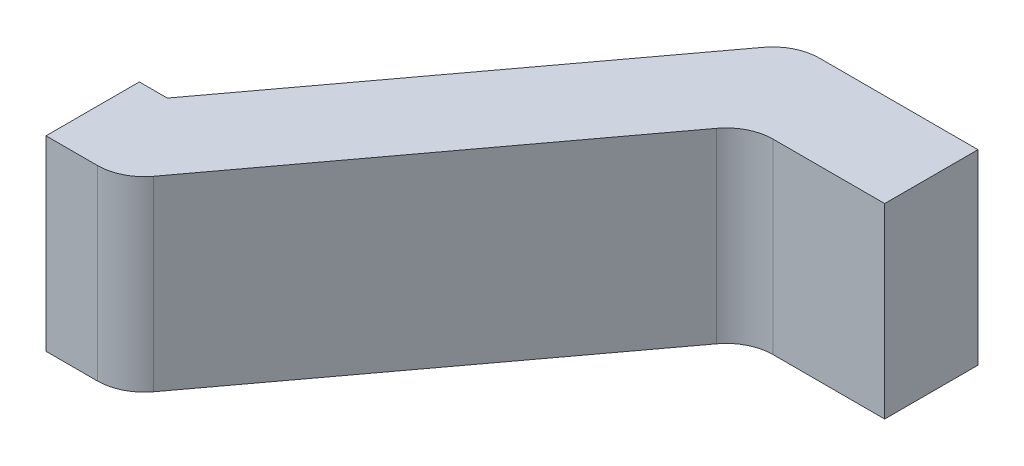
ISO-10303-21;
HEADER;
FILE_DESCRIPTION(('STEP AP214'),'2;1');
FILE_NAME('part.step','',(''),(''),'','','');
FILE_SCHEMA(('AUTOMOTIVE_DESIGN { 1 0 10303 214 1 1 1 1 }'));
ENDSEC;
DATA;
#1=APPLICATION_CONTEXT('core data for automotive mechanical design processes');
#2=APPLICATION_PROTOCOL_DEFINITION('international standard','automotive_design',2000,#1);
#3=PRODUCT_CONTEXT('',#1,'mechanical');
#4=PRODUCT('Part','Part','',(#3));
#5=PRODUCT_RELATED_PRODUCT_CATEGORY('part','',(#4));
#6=PRODUCT_DEFINITION_FORMATION('','',#4);
#7=PRODUCT_DEFINITION_CONTEXT('part definition',#1,'design');
#8=PRODUCT_DEFINITION('design','',#6,#7);
#9=PRODUCT_DEFINITION_SHAPE('','',#8);
#10=(LENGTH_UNIT() NAMED_UNIT(*) SI_UNIT(.MILLI.,.METRE.));
#11=(NAMED_UNIT(*) PLANE_ANGLE_UNIT() SI_UNIT($,.RADIAN.));
#12=(NAMED_UNIT(*) SI_UNIT($,.STERADIAN.) SOLID_ANGLE_UNIT());
#13=UNCERTAINTY_MEASURE_WITH_UNIT(LENGTH_MEASURE(1.E-05),#10,'distance_accuracy_value','');
#14=(GEOMETRIC_REPRESENTATION_CONTEXT(3) GLOBAL_UNCERTAINTY_ASSIGNED_CONTEXT((#13)) GLOBAL_UNIT_ASSIGNED_CONTEXT((#10,
#11,#12)) REPRESENTATION_CONTEXT('',''));
#15=CARTESIAN_POINT('',(0.,0.,0.));
#16=DIRECTION('',(0.,0.,1.));
#17=DIRECTION('',(1.,0.,0.));
#18=AXIS2_PLACEMENT_3D('',#15,#16,#17);
#19=CARTESIAN_POINT('',(2.6,0.43,0.205));
#20=DIRECTION('',(0.,0.,1.));
#21=DIRECTION('',(1.,0.,0.));
#22=AXIS2_PLACEMENT_3D('',#19,#20,#21);
#23=PLANE('',#22);
#24=DIRECTION('',(1.,0.,0.));
#25=VECTOR('',#24,1.);
#26=CARTESIAN_POINT('',(2.6,0.84,0.205));
#27=LINE('',#26,#25);
#28=CARTESIAN_POINT('',(2.754632601552,0.84,0.205));
#29=VERTEX_POINT('',#28);
#30=CARTESIAN_POINT('',(3.,0.84,0.205));
#31=VERTEX_POINT('',#30);
#32=EDGE_CURVE('E11',#29,#31,#27,.T.);
#33=ORIENTED_EDGE('',*,*,#32,.F.);
#34=DIRECTION('',(0.,1.,0.));
#35=VECTOR('',#34,1.);
#36=CARTESIAN_POINT('',(2.754632601552,0.43,0.205));
#37=LINE('',#36,#35);
#38=CARTESIAN_POINT('',(2.754632601552,0.43,0.205));
#39=VERTEX_POINT('',#38);
#40=EDGE_CURVE('E24',#39,#29,#37,.T.);
#41=ORIENTED_EDGE('',*,*,#40,.F.);
#42=DIRECTION('',(1.,0.,0.));
#43=VECTOR('',#42,1.);
#44=CARTESIAN_POINT('',(2.6,0.43,0.205));
#45=LINE('',#44,#43);
#46=CARTESIAN_POINT('',(3.,0.43,0.205));
#47=VERTEX_POINT('',#46);
#48=EDGE_CURVE('E172',#39,#47,#45,.T.);
#49=ORIENTED_EDGE('',*,*,#48,.T.);
#50=DIRECTION('',(0.,1.,0.));
#51=VECTOR('',#50,1.);
#52=CARTESIAN_POINT('',(3.,0.43,0.205));
#53=LINE('',#52,#51);
#54=EDGE_CURVE('E170',#47,#31,#53,.T.);
#55=ORIENTED_EDGE('',*,*,#54,.T.);
#56=EDGE_LOOP('',(#33,#41,#49,#55));
#57=FACE_BOUND('',#56,.T.);
#58=ADVANCED_FACE('F17',(#57),#23,.T.);
#59=CARTESIAN_POINT('',(2.6,0.84,0.));
#60=DIRECTION('',(0.,1.,0.));
#61=DIRECTION('',(0.,0.,1.));
#62=AXIS2_PLACEMENT_3D('',#59,#60,#61);
#63=PLANE('',#62);
#64=DIRECTION('',(1.,0.,0.));
#65=VECTOR('',#64,1.);
#66=CARTESIAN_POINT('',(2.6,0.84,0.));
#67=LINE('',#66,#65);
#68=CARTESIAN_POINT('',(2.651544200517,0.84,0.));
#69=VERTEX_POINT('',#68);
#70=CARTESIAN_POINT('',(3.,0.84,0.));
#71=VERTEX_POINT('',#70);
#72=EDGE_CURVE('E168',#69,#71,#67,.T.);
#73=ORIENTED_EDGE('',*,*,#72,.F.);
#74=CARTESIAN_POINT('',(2.651544200517,0.84,0.1025));
#75=DIRECTION('',(0.,1.,0.));
#76=DIRECTION('',(0.,0.,1.));
#77=AXIS2_PLACEMENT_3D('',#74,#75,#76);
#78=CIRCLE('',#77,0.1025);
#79=CARTESIAN_POINT('',(2.569262956102,0.84,0.0413767898629));
#80=VERTEX_POINT('',#79);
#81=EDGE_CURVE('E118',#69,#80,#78,.T.);
#82=ORIENTED_EDGE('',*,*,#81,.T.);
#83=DIRECTION('',(-0.596324001338072,0.,0.802743847954097));
#84=VECTOR('',#83,1.);
#85=CARTESIAN_POINT('',(2.6,0.84,0.));
#86=LINE('',#85,#84);
#87=CARTESIAN_POINT('',(2.011474087796,0.84,0.792246420274));
#88=VERTEX_POINT('',#87);
#89=EDGE_CURVE('E165',#80,#88,#86,.T.);
#90=ORIENTED_EDGE('',*,*,#89,.T.);
#91=DIRECTION('',(1.,0.,0.));
#92=VECTOR('',#91,1.);
#93=CARTESIAN_POINT('',(1.95,0.84,0.792246420274));
#94=LINE('',#93,#92);
#95=CARTESIAN_POINT('',(1.95,0.84,0.792246420274));
#96=VERTEX_POINT('',#95);
#97=EDGE_CURVE('E162',#96,#88,#94,.T.);
#98=ORIENTED_EDGE('',*,*,#97,.F.);
#99=DIRECTION('',(0.,0.,1.));
#100=VECTOR('',#99,1.);
#101=CARTESIAN_POINT('',(1.95,0.84,0.792246420274));
#102=LINE('',#101,#100);
#103=CARTESIAN_POINT('',(1.95,0.84,0.997246420274));
#104=VERTEX_POINT('',#103);
#105=EDGE_CURVE('E160',#96,#104,#102,.T.);
#106=ORIENTED_EDGE('',*,*,#105,.T.);
#107=DIRECTION('',(1.,0.,0.));
#108=VECTOR('',#107,1.);
#109=CARTESIAN_POINT('',(1.95,0.84,0.997246420274));
#110=LINE('',#109,#108);
#111=CARTESIAN_POINT('',(2.063018288313,0.84,0.997246420274));
#112=VERTEX_POINT('',#111);
#113=EDGE_CURVE('E158',#104,#112,#110,.T.);
#114=ORIENTED_EDGE('',*,*,#113,.T.);
#115=CARTESIAN_POINT('',(2.063018288313,0.84,0.894746420274));
#116=DIRECTION('',(0.,-1.,0.));
#117=DIRECTION('',(0.,0.,1.));
#118=AXIS2_PLACEMENT_3D('',#115,#116,#117);
#119=CIRCLE('',#118,0.1025);
#120=CARTESIAN_POINT('',(2.145299532729,0.84,0.955869630411));
#121=VERTEX_POINT('',#120);
#122=EDGE_CURVE('E155',#121,#112,#119,.T.);
#123=ORIENTED_EDGE('',*,*,#122,.F.);
#124=DIRECTION('',(-0.596324001338072,0.,0.802743847954097));
#125=VECTOR('',#124,1.);
#126=CARTESIAN_POINT('',(2.764562488831,0.84,0.122246420274));
#127=LINE('',#126,#125);
#128=CARTESIAN_POINT('',(2.672351357136,0.84,0.246376789863));
#129=VERTEX_POINT('',#128);
#130=EDGE_CURVE('E152',#129,#121,#127,.T.);
#131=ORIENTED_EDGE('',*,*,#130,.F.);
#132=CARTESIAN_POINT('',(2.754632601552,0.84,0.3075));
#133=DIRECTION('',(0.,1.,0.));
#134=DIRECTION('',(0.,0.,1.));
#135=AXIS2_PLACEMENT_3D('',#132,#133,#134);
#136=CIRCLE('',#135,0.1025);
#137=EDGE_CURVE('E149',#29,#129,#136,.T.);
#138=ORIENTED_EDGE('',*,*,#137,.F.);
#139=ORIENTED_EDGE('',*,*,#32,.T.);
#140=DIRECTION('',(0.,0.,1.));
#141=VECTOR('',#140,1.);
#142=CARTESIAN_POINT('',(3.,0.84,0.));
#143=LINE('',#142,#141);
#144=EDGE_CURVE('E146',#71,#31,#143,.T.);
#145=ORIENTED_EDGE('',*,*,#144,.F.);
#146=EDGE_LOOP('',(#73,#82,#90,#98,#106,#114,#123,#131,#138,#139,#145));
#147=FACE_BOUND('',#146,.T.);
#148=ADVANCED_FACE('F178',(#147),#63,.T.);
#149=CARTESIAN_POINT('',(2.754632601552,0.43,0.3075));
#150=DIRECTION('',(0.,1.,0.));
#151=DIRECTION('',(0.,0.,-1.));
#152=AXIS2_PLACEMENT_3D('',#149,#150,#151);
#153=CYLINDRICAL_SURFACE('',#152,0.1025);
#154=ORIENTED_EDGE('',*,*,#40,.T.);
#155=ORIENTED_EDGE('',*,*,#137,.T.);
#156=DIRECTION('',(0.,1.,0.));
#157=VECTOR('',#156,1.);
#158=CARTESIAN_POINT('',(2.672351357136,0.43,0.246376789863));
#159=LINE('',#158,#157);
#160=CARTESIAN_POINT('',(2.672351357136,0.43,0.246376789863));
#161=VERTEX_POINT('',#160);
#162=EDGE_CURVE('E143',#161,#129,#159,.T.);
#163=ORIENTED_EDGE('',*,*,#162,.F.);
#164=CARTESIAN_POINT('',(2.754632601552,0.43,0.3075));
#165=DIRECTION('',(0.,1.,0.));
#166=DIRECTION('',(0.,0.,1.));
#167=AXIS2_PLACEMENT_3D('',#164,#165,#166);
#168=CIRCLE('',#167,0.1025);
#169=EDGE_CURVE('E141',#39,#161,#168,.T.);
#170=ORIENTED_EDGE('',*,*,#169,.F.);
#171=EDGE_LOOP('',(#154,#155,#163,#170));
#172=FACE_BOUND('',#171,.T.);
#173=ADVANCED_FACE('F175',(#172),#153,.F.);
#174=CARTESIAN_POINT('',(3.,0.43,0.));
#175=DIRECTION('',(1.,0.,0.));
#176=DIRECTION('',(0.,0.,1.));
#177=AXIS2_PLACEMENT_3D('',#174,#175,#176);
#178=PLANE('',#177);
#179=DIRECTION('',(0.,0.,1.));
#180=VECTOR('',#179,1.);
#181=CARTESIAN_POINT('',(3.,0.43,0.));
#182=LINE('',#181,#180);
#183=CARTESIAN_POINT('',(3.,0.43,0.));
#184=VERTEX_POINT('',#183);
#185=EDGE_CURVE('E139',#184,#47,#182,.T.);
#186=ORIENTED_EDGE('',*,*,#185,.F.);
#187=DIRECTION('',(0.,1.,0.));
#188=VECTOR('',#187,1.);
#189=CARTESIAN_POINT('',(3.,0.43,0.));
#190=LINE('',#189,#188);
#191=EDGE_CURVE('E103',#184,#71,#190,.T.);
#192=ORIENTED_EDGE('',*,*,#191,.T.);
#193=ORIENTED_EDGE('',*,*,#144,.T.);
#194=ORIENTED_EDGE('',*,*,#54,.F.);
#195=EDGE_LOOP('',(#186,#192,#193,#194));
#196=FACE_BOUND('',#195,.T.);
#197=ADVANCED_FACE('F217',(#196),#178,.T.);
#198=CARTESIAN_POINT('',(2.6,0.43,0.));
#199=DIRECTION('',(0.,1.,0.));
#200=DIRECTION('',(0.,0.,1.));
#201=AXIS2_PLACEMENT_3D('',#198,#199,#200);
#202=PLANE('',#201);
#203=ORIENTED_EDGE('',*,*,#185,.T.);
#204=ORIENTED_EDGE('',*,*,#48,.F.);
#205=ORIENTED_EDGE('',*,*,#169,.T.);
#206=DIRECTION('',(-0.596324001338072,0.,0.802743847954097));
#207=VECTOR('',#206,1.);
#208=CARTESIAN_POINT('',(2.764562488831,0.43,0.122246420274));
#209=LINE('',#208,#207);
#210=CARTESIAN_POINT('',(2.145299532729,0.43,0.955869630411));
#211=VERTEX_POINT('',#210);
#212=EDGE_CURVE('E135',#161,#211,#209,.T.);
#213=ORIENTED_EDGE('',*,*,#212,.T.);
#214=CARTESIAN_POINT('',(2.063018288313,0.43,0.894746420274));
#215=DIRECTION('',(0.,-1.,0.));
#216=DIRECTION('',(0.,0.,1.));
#217=AXIS2_PLACEMENT_3D('',#214,#215,#216);
#218=CIRCLE('',#217,0.1025);
#219=CARTESIAN_POINT('',(2.063018288313,0.43,0.997246420274));
#220=VERTEX_POINT('',#219);
#221=EDGE_CURVE('E132',#211,#220,#218,.T.);
#222=ORIENTED_EDGE('',*,*,#221,.T.);
#223=DIRECTION('',(1.,0.,0.));
#224=VECTOR('',#223,1.);
#225=CARTESIAN_POINT('',(1.95,0.43,0.997246420274));
#226=LINE('',#225,#224);
#227=CARTESIAN_POINT('',(1.95,0.43,0.997246420274));
#228=VERTEX_POINT('',#227);
#229=EDGE_CURVE('E130',#228,#220,#226,.T.);
#230=ORIENTED_EDGE('',*,*,#229,.F.);
#231=DIRECTION('',(0.,0.,1.));
#232=VECTOR('',#231,1.);
#233=CARTESIAN_POINT('',(1.95,0.43,0.792246420274));
#234=LINE('',#233,#232);
#235=CARTESIAN_POINT('',(1.95,0.43,0.792246420274));
#236=VERTEX_POINT('',#235);
#237=EDGE_CURVE('E128',#236,#228,#234,.T.);
#238=ORIENTED_EDGE('',*,*,#237,.F.);
#239=DIRECTION('',(1.,0.,0.));
#240=VECTOR('',#239,1.);
#241=CARTESIAN_POINT('',(1.95,0.43,0.792246420274));
#242=LINE('',#241,#240);
#243=CARTESIAN_POINT('',(2.011474087796,0.43,0.792246420274));
#244=VERTEX_POINT('',#243);
#245=EDGE_CURVE('E126',#236,#244,#242,.T.);
#246=ORIENTED_EDGE('',*,*,#245,.T.);
#247=DIRECTION('',(-0.596324001338072,0.,0.802743847954097));
#248=VECTOR('',#247,1.);
#249=CARTESIAN_POINT('',(2.6,0.43,0.));
#250=LINE('',#249,#248);
#251=CARTESIAN_POINT('',(2.569262956102,0.43,0.0413767898629));
#252=VERTEX_POINT('',#251);
#253=EDGE_CURVE('E111',#252,#244,#250,.T.);
#254=ORIENTED_EDGE('',*,*,#253,.F.);
#255=CARTESIAN_POINT('',(2.651544200517,0.43,0.1025));
#256=DIRECTION('',(0.,1.,0.));
#257=DIRECTION('',(0.,0.,1.));
#258=AXIS2_PLACEMENT_3D('',#255,#256,#257);
#259=CIRCLE('',#258,0.1025);
#260=CARTESIAN_POINT('',(2.651544200517,0.43,0.));
#261=VERTEX_POINT('',#260);
#262=EDGE_CURVE('E106',#261,#252,#259,.T.);
#263=ORIENTED_EDGE('',*,*,#262,.F.);
#264=DIRECTION('',(1.,0.,0.));
#265=VECTOR('',#264,1.);
#266=CARTESIAN_POINT('',(2.6,0.43,0.));
#267=LINE('',#266,#265);
#268=EDGE_CURVE('E97',#261,#184,#267,.T.);
#269=ORIENTED_EDGE('',*,*,#268,.T.);
#270=EDGE_LOOP('',(#203,#204,#205,#213,#222,#230,#238,#246,#254,#263,#269));
#271=FACE_BOUND('',#270,.T.);
#272=ADVANCED_FACE('F109',(#271),#202,.F.);
#273=CARTESIAN_POINT('',(2.6,0.43,0.));
#274=DIRECTION('',(0.,0.,1.));
#275=DIRECTION('',(1.,0.,0.));
#276=AXIS2_PLACEMENT_3D('',#273,#274,#275);
#277=PLANE('',#276);
#278=DIRECTION('',(0.,1.,0.));
#279=VECTOR('',#278,1.);
#280=CARTESIAN_POINT('',(2.651544200517,0.43,0.));
#281=LINE('',#280,#279);
#282=EDGE_CURVE('E101',#261,#69,#281,.T.);
#283=ORIENTED_EDGE('',*,*,#282,.T.);
#284=ORIENTED_EDGE('',*,*,#72,.T.);
#285=ORIENTED_EDGE('',*,*,#191,.F.);
#286=ORIENTED_EDGE('',*,*,#268,.F.);
#287=EDGE_LOOP('',(#283,#284,#285,#286));
#288=FACE_BOUND('',#287,.T.);
#289=ADVANCED_FACE('F99',(#288),#277,.F.);
#290=CARTESIAN_POINT('',(2.651544200517,0.43,0.1025));
#291=DIRECTION('',(0.,1.,0.));
#292=DIRECTION('',(0.,0.,-1.));
#293=AXIS2_PLACEMENT_3D('',#290,#291,#292);
#294=CYLINDRICAL_SURFACE('',#293,0.1025);
#295=ORIENTED_EDGE('',*,*,#262,.T.);
#296=DIRECTION('',(0.,1.,0.));
#297=VECTOR('',#296,1.);
#298=CARTESIAN_POINT('',(2.569262956102,0.43,0.0413767898629));
#299=LINE('',#298,#297);
#300=EDGE_CURVE('E119',#252,#80,#299,.T.);
#301=ORIENTED_EDGE('',*,*,#300,.T.);
#302=ORIENTED_EDGE('',*,*,#81,.F.);
#303=ORIENTED_EDGE('',*,*,#282,.F.);
#304=EDGE_LOOP('',(#295,#301,#302,#303));
#305=FACE_BOUND('',#304,.T.);
#306=ADVANCED_FACE('F117',(#305),#294,.T.);
#307=CARTESIAN_POINT('',(2.6,0.43,0.));
#308=DIRECTION('',(0.802743847954097,0.,0.596324001338072));
#309=DIRECTION('',(-0.596324001338072,0.,0.802743847954097));
#310=AXIS2_PLACEMENT_3D('',#307,#308,#309);
#311=PLANE('',#310);
#312=DIRECTION('',(0.,1.,0.));
#313=VECTOR('',#312,1.);
#314=CARTESIAN_POINT('',(2.011474087796,0.43,0.792246420274));
#315=LINE('',#314,#313);
#316=EDGE_CURVE('E121',#244,#88,#315,.T.);
#317=ORIENTED_EDGE('',*,*,#316,.T.);
#318=ORIENTED_EDGE('',*,*,#89,.F.);
#319=ORIENTED_EDGE('',*,*,#300,.F.);
#320=ORIENTED_EDGE('',*,*,#253,.T.);
#321=EDGE_LOOP('',(#317,#318,#319,#320));
#322=FACE_BOUND('',#321,.T.);
#323=ADVANCED_FACE('F202',(#322),#311,.F.);
#324=CARTESIAN_POINT('',(1.95,0.43,0.792246420274));
#325=DIRECTION('',(0.,0.,1.));
#326=DIRECTION('',(1.,0.,0.));
#327=AXIS2_PLACEMENT_3D('',#324,#325,#326);
#328=PLANE('',#327);
#329=ORIENTED_EDGE('',*,*,#316,.F.);
#330=ORIENTED_EDGE('',*,*,#245,.F.);
#331=DIRECTION('',(0.,1.,0.));
#332=VECTOR('',#331,1.);
#333=CARTESIAN_POINT('',(1.95,0.43,0.792246420274));
#334=LINE('',#333,#332);
#335=EDGE_CURVE('E193',#236,#96,#334,.T.);
#336=ORIENTED_EDGE('',*,*,#335,.T.);
#337=ORIENTED_EDGE('',*,*,#97,.T.);
#338=EDGE_LOOP('',(#329,#330,#336,#337));
#339=FACE_BOUND('',#338,.T.);
#340=ADVANCED_FACE('F204',(#339),#328,.F.);
#341=CARTESIAN_POINT('',(1.95,0.43,0.792246420274));
#342=DIRECTION('',(1.,0.,0.));
#343=DIRECTION('',(0.,0.,1.));
#344=AXIS2_PLACEMENT_3D('',#341,#342,#343);
#345=PLANE('',#344);
#346=ORIENTED_EDGE('',*,*,#237,.T.);
#347=DIRECTION('',(0.,1.,0.));
#348=VECTOR('',#347,1.);
#349=CARTESIAN_POINT('',(1.95,0.43,0.997246420274));
#350=LINE('',#349,#348);
#351=EDGE_CURVE('E189',#228,#104,#350,.T.);
#352=ORIENTED_EDGE('',*,*,#351,.T.);
#353=ORIENTED_EDGE('',*,*,#105,.F.);
#354=ORIENTED_EDGE('',*,*,#335,.F.);
#355=EDGE_LOOP('',(#346,#352,#353,#354));
#356=FACE_BOUND('',#355,.T.);
#357=ADVANCED_FACE('F210',(#356),#345,.F.);
#358=CARTESIAN_POINT('',(2.764562488831,0.43,0.122246420274));
#359=DIRECTION('',(0.802743847954097,0.,0.596324001338072));
#360=DIRECTION('',(-0.596324001338072,0.,0.802743847954097));
#361=AXIS2_PLACEMENT_3D('',#358,#359,#360);
#362=PLANE('',#361);
#363=ORIENTED_EDGE('',*,*,#212,.F.);
#364=ORIENTED_EDGE('',*,*,#162,.T.);
#365=ORIENTED_EDGE('',*,*,#130,.T.);
#366=DIRECTION('',(0.,1.,0.));
#367=VECTOR('',#366,1.);
#368=CARTESIAN_POINT('',(2.145299532729,0.43,0.955869630411));
#369=LINE('',#368,#367);
#370=EDGE_CURVE('E184',#211,#121,#369,.T.);
#371=ORIENTED_EDGE('',*,*,#370,.F.);
#372=EDGE_LOOP('',(#363,#364,#365,#371));
#373=FACE_BOUND('',#372,.T.);
#374=ADVANCED_FACE('F183',(#373),#362,.T.);
#375=CARTESIAN_POINT('',(1.95,0.43,0.997246420274));
#376=DIRECTION('',(0.,0.,1.));
#377=DIRECTION('',(1.,0.,0.));
#378=AXIS2_PLACEMENT_3D('',#375,#376,#377);
#379=PLANE('',#378);
#380=ORIENTED_EDGE('',*,*,#113,.F.);
#381=ORIENTED_EDGE('',*,*,#351,.F.);
#382=ORIENTED_EDGE('',*,*,#229,.T.);
#383=DIRECTION('',(0.,1.,0.));
#384=VECTOR('',#383,1.);
#385=CARTESIAN_POINT('',(2.063018288313,0.43,0.997246420274));
#386=LINE('',#385,#384);
#387=EDGE_CURVE('E190',#220,#112,#386,.T.);
#388=ORIENTED_EDGE('',*,*,#387,.T.);
#389=EDGE_LOOP('',(#380,#381,#382,#388));
#390=FACE_BOUND('',#389,.T.);
#391=ADVANCED_FACE('F214',(#390),#379,.T.);
#392=CARTESIAN_POINT('',(2.063018288313,0.43,0.894746420274));
#393=DIRECTION('',(0.,1.,0.));
#394=DIRECTION('',(0.802743847954097,0.,0.596324001338072));
#395=AXIS2_PLACEMENT_3D('',#392,#393,#394);
#396=CYLINDRICAL_SURFACE('',#395,0.1025);
#397=ORIENTED_EDGE('',*,*,#370,.T.);
#398=ORIENTED_EDGE('',*,*,#122,.T.);
#399=ORIENTED_EDGE('',*,*,#387,.F.);
#400=ORIENTED_EDGE('',*,*,#221,.F.);
#401=EDGE_LOOP('',(#397,#398,#399,#400));
#402=FACE_BOUND('',#401,.T.);
#403=ADVANCED_FACE('F186',(#402),#396,.T.);
#404=CLOSED_SHELL('',(#58,#148,#173,#197,#272,#289,#306,#323,#340,#357,#374,#391,#403));
#405=MANIFOLD_SOLID_BREP('B1',#404);
#406=ADVANCED_BREP_SHAPE_REPRESENTATION('',(#18,#405),#14);
#407=SHAPE_DEFINITION_REPRESENTATION(#9,#406);
ENDSEC;
END-ISO-10303-21;
